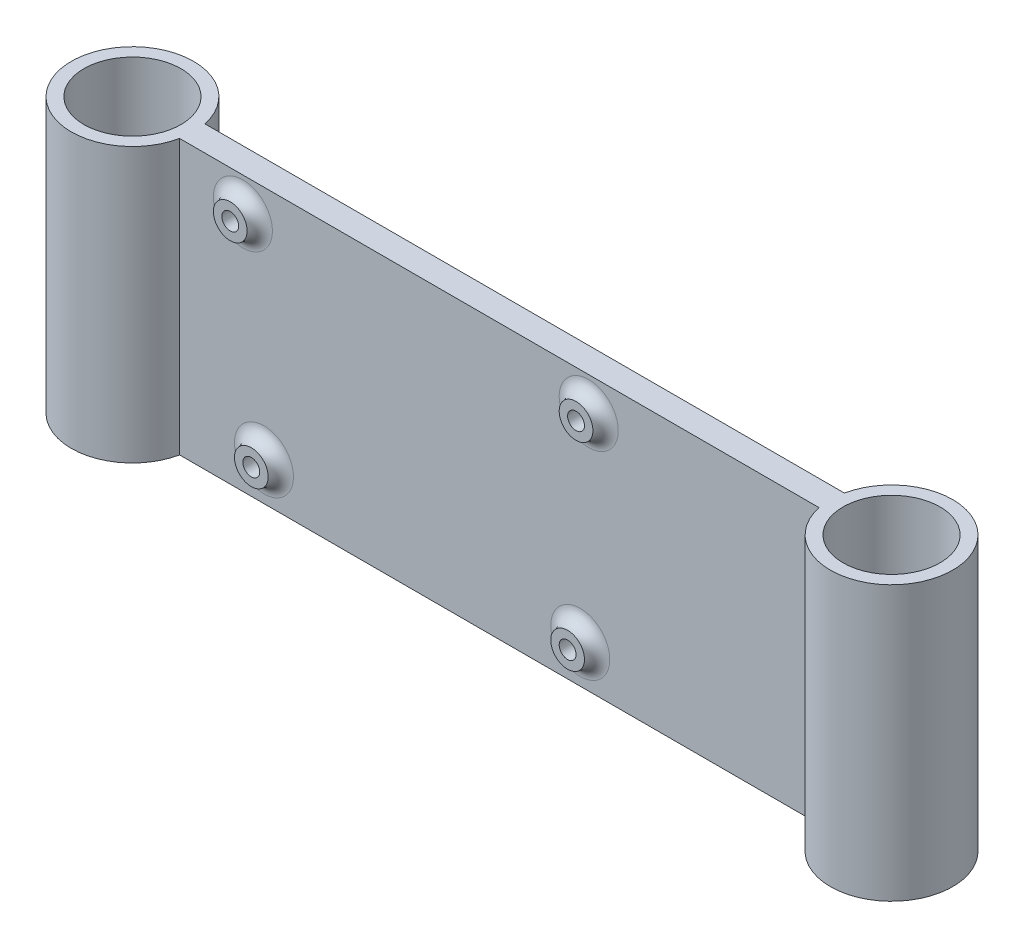
ISO-10303-21;
HEADER;
FILE_DESCRIPTION(('STEP AP214'),'2;1');
FILE_NAME('part.step','',(''),(''),'','','');
FILE_SCHEMA(('AUTOMOTIVE_DESIGN { 1 0 10303 214 1 1 1 1 }'));
ENDSEC;
DATA;
#1=APPLICATION_CONTEXT('core data for automotive mechanical design processes');
#2=APPLICATION_PROTOCOL_DEFINITION('international standard','automotive_design',2000,#1);
#3=PRODUCT_CONTEXT('',#1,'mechanical');
#4=PRODUCT('Part','Part','',(#3));
#5=PRODUCT_RELATED_PRODUCT_CATEGORY('part','',(#4));
#6=PRODUCT_DEFINITION_FORMATION('','',#4);
#7=PRODUCT_DEFINITION_CONTEXT('part definition',#1,'design');
#8=PRODUCT_DEFINITION('design','',#6,#7);
#9=PRODUCT_DEFINITION_SHAPE('','',#8);
#10=(LENGTH_UNIT() NAMED_UNIT(*) SI_UNIT(.MILLI.,.METRE.));
#11=(NAMED_UNIT(*) PLANE_ANGLE_UNIT() SI_UNIT($,.RADIAN.));
#12=(NAMED_UNIT(*) SI_UNIT($,.STERADIAN.) SOLID_ANGLE_UNIT());
#13=UNCERTAINTY_MEASURE_WITH_UNIT(LENGTH_MEASURE(1.E-05),#10,'distance_accuracy_value','');
#14=(GEOMETRIC_REPRESENTATION_CONTEXT(3) GLOBAL_UNCERTAINTY_ASSIGNED_CONTEXT((#13)) GLOBAL_UNIT_ASSIGNED_CONTEXT((#10,
#11,#12)) REPRESENTATION_CONTEXT('',''));
#15=CARTESIAN_POINT('',(0.,0.,0.));
#16=DIRECTION('',(0.,0.,1.));
#17=DIRECTION('',(1.,0.,0.));
#18=AXIS2_PLACEMENT_3D('',#15,#16,#17);
#19=CARTESIAN_POINT('',(-28.3531574831731,65.,3.00000000000001));
#20=DIRECTION('',(0.,0.,-1.));
#21=DIRECTION('',(-1.,0.,0.));
#22=AXIS2_PLACEMENT_3D('',#19,#20,#21);
#23=PLANE('',#22);
#24=CARTESIAN_POINT('',(68.6468425168269,57.,3.00000000000001));
#25=DIRECTION('',(0.,0.,-1.));
#26=DIRECTION('',(-1.,0.,0.));
#27=AXIS2_PLACEMENT_3D('',#24,#25,#26);
#28=CIRCLE('',#27,7.00000000000001);
#29=CARTESIAN_POINT('',(61.6468425168269,57.,3.00000000000001));
#30=VERTEX_POINT('',#29);
#31=EDGE_CURVE('E11',#30,#30,#28,.T.);
#32=ORIENTED_EDGE('',*,*,#31,.T.);
#33=EDGE_LOOP('',(#32));
#34=FACE_BOUND('',#33,.T.);
#35=CARTESIAN_POINT('',(66.6468425168269,9.,3.00000000000001));
#36=DIRECTION('',(0.,0.,-1.));
#37=DIRECTION('',(-1.,0.,0.));
#38=AXIS2_PLACEMENT_3D('',#35,#36,#37);
#39=CIRCLE('',#38,7.00000000000001);
#40=CARTESIAN_POINT('',(59.6468425168269,9.,3.00000000000001));
#41=VERTEX_POINT('',#40);
#42=EDGE_CURVE('E42',#41,#41,#39,.T.);
#43=ORIENTED_EDGE('',*,*,#42,.T.);
#44=EDGE_LOOP('',(#43));
#45=FACE_BOUND('',#44,.T.);
#46=CARTESIAN_POINT('',(-8.35315748317308,9.,3.00000000000001));
#47=DIRECTION('',(0.,0.,-1.));
#48=DIRECTION('',(-1.,0.,0.));
#49=AXIS2_PLACEMENT_3D('',#46,#47,#48);
#50=CIRCLE('',#49,7.00000000000001);
#51=CARTESIAN_POINT('',(-15.3531574831731,9.,3.00000000000001));
#52=VERTEX_POINT('',#51);
#53=EDGE_CURVE('E128',#52,#52,#50,.T.);
#54=ORIENTED_EDGE('',*,*,#53,.T.);
#55=EDGE_LOOP('',(#54));
#56=FACE_BOUND('',#55,.T.);
#57=CARTESIAN_POINT('',(-13.3531574831731,57.,3.00000000000001));
#58=DIRECTION('',(0.,0.,-1.));
#59=DIRECTION('',(-1.,0.,0.));
#60=AXIS2_PLACEMENT_3D('',#57,#58,#59);
#61=CIRCLE('',#60,7.00000000000001);
#62=CARTESIAN_POINT('',(-20.3531574831731,57.,3.00000000000001));
#63=VERTEX_POINT('',#62);
#64=EDGE_CURVE('E111',#63,#63,#61,.T.);
#65=ORIENTED_EDGE('',*,*,#64,.T.);
#66=EDGE_LOOP('',(#65));
#67=FACE_BOUND('',#66,.T.);
#68=DIRECTION('',(1.,0.,0.));
#69=VECTOR('',#68,1.);
#70=CARTESIAN_POINT('',(-28.3531574831731,0.,3.00000000000001));
#71=LINE('',#70,#69);
#72=CARTESIAN_POINT('',(-28.3531574831731,0.,3.00000000000001));
#73=VERTEX_POINT('',#72);
#74=CARTESIAN_POINT('',(123.274320598605,0.,3.00000000000001));
#75=VERTEX_POINT('',#74);
#76=EDGE_CURVE('E91',#73,#75,#71,.T.);
#77=ORIENTED_EDGE('',*,*,#76,.T.);
#78=DIRECTION('',(0.,-1.,0.));
#79=VECTOR('',#78,1.);
#80=CARTESIAN_POINT('',(123.274320598605,65.,3.00000000000001));
#81=LINE('',#80,#79);
#82=CARTESIAN_POINT('',(123.274320598605,65.,3.00000000000001));
#83=VERTEX_POINT('',#82);
#84=EDGE_CURVE('E90',#83,#75,#81,.T.);
#85=ORIENTED_EDGE('',*,*,#84,.F.);
#86=DIRECTION('',(1.,0.,0.));
#87=VECTOR('',#86,1.);
#88=CARTESIAN_POINT('',(-28.3531574831731,65.,3.00000000000001));
#89=LINE('',#88,#87);
#90=CARTESIAN_POINT('',(-28.3531574831731,65.,3.00000000000001));
#91=VERTEX_POINT('',#90);
#92=EDGE_CURVE('E81',#91,#83,#89,.T.);
#93=ORIENTED_EDGE('',*,*,#92,.F.);
#94=DIRECTION('',(0.,-1.,0.));
#95=VECTOR('',#94,1.);
#96=CARTESIAN_POINT('',(-28.3531574831731,65.,3.00000000000001));
#97=LINE('',#96,#95);
#98=EDGE_CURVE('E92',#91,#73,#97,.T.);
#99=ORIENTED_EDGE('',*,*,#98,.T.);
#100=EDGE_LOOP('',(#77,#85,#93,#99));
#101=FACE_BOUND('',#100,.T.);
#102=ADVANCED_FACE('F33',(#34,#45,#56,#67,#101),#23,.F.);
#103=CARTESIAN_POINT('',(-42.5394184422842,65.,0.));
#104=DIRECTION('',(0.,-1.,0.));
#105=DIRECTION('',(0.,0.,-1.));
#106=AXIS2_PLACEMENT_3D('',#103,#104,#105);
#107=PLANE('',#106);
#108=CARTESIAN_POINT('',(-42.5394184422842,65.,0.));
#109=DIRECTION('',(0.,1.,0.));
#110=DIRECTION('',(0.,0.,-1.));
#111=AXIS2_PLACEMENT_3D('',#108,#109,#110);
#112=CIRCLE('',#111,14.5);
#113=CARTESIAN_POINT('',(-28.3531574831731,65.,-2.99999999999999));
#114=VERTEX_POINT('',#113);
#115=EDGE_CURVE('E87',#114,#91,#112,.T.);
#116=ORIENTED_EDGE('',*,*,#115,.T.);
#117=ORIENTED_EDGE('',*,*,#92,.T.);
#118=CARTESIAN_POINT('',(137.460581557716,65.,0.));
#119=DIRECTION('',(0.,1.,0.));
#120=DIRECTION('',(0.,0.,-1.));
#121=AXIS2_PLACEMENT_3D('',#118,#119,#120);
#122=CIRCLE('',#121,14.5);
#123=CARTESIAN_POINT('',(123.274320598605,65.,-2.99999999999999));
#124=VERTEX_POINT('',#123);
#125=EDGE_CURVE('E85',#83,#124,#122,.T.);
#126=ORIENTED_EDGE('',*,*,#125,.T.);
#127=DIRECTION('',(-1.,0.,0.));
#128=VECTOR('',#127,1.);
#129=CARTESIAN_POINT('',(-28.3531574831731,65.,-2.99999999999999));
#130=LINE('',#129,#128);
#131=EDGE_CURVE('E50',#124,#114,#130,.T.);
#132=ORIENTED_EDGE('',*,*,#131,.T.);
#133=EDGE_LOOP('',(#116,#117,#126,#132));
#134=FACE_BOUND('',#133,.T.);
#135=CARTESIAN_POINT('',(-42.5394184422842,65.,0.));
#136=DIRECTION('',(0.,1.,0.));
#137=DIRECTION('',(0.,0.,1.));
#138=AXIS2_PLACEMENT_3D('',#135,#136,#137);
#139=CIRCLE('',#138,11.5);
#140=CARTESIAN_POINT('',(-42.5394184422842,65.,11.5));
#141=VERTEX_POINT('',#140);
#142=EDGE_CURVE('E104',#141,#141,#139,.T.);
#143=ORIENTED_EDGE('',*,*,#142,.F.);
#144=EDGE_LOOP('',(#143));
#145=FACE_BOUND('',#144,.T.);
#146=CARTESIAN_POINT('',(137.460581557716,65.,0.));
#147=DIRECTION('',(0.,1.,0.));
#148=DIRECTION('',(0.,0.,1.));
#149=AXIS2_PLACEMENT_3D('',#146,#147,#148);
#150=CIRCLE('',#149,11.5);
#151=CARTESIAN_POINT('',(137.460581557716,65.,11.5));
#152=VERTEX_POINT('',#151);
#153=EDGE_CURVE('E167',#152,#152,#150,.T.);
#154=ORIENTED_EDGE('',*,*,#153,.F.);
#155=EDGE_LOOP('',(#154));
#156=FACE_BOUND('',#155,.T.);
#157=ADVANCED_FACE('F82',(#134,#145,#156),#107,.F.);
#158=CARTESIAN_POINT('',(-42.5394184422842,0.,0.));
#159=DIRECTION('',(0.,-1.,0.));
#160=DIRECTION('',(0.,0.,-1.));
#161=AXIS2_PLACEMENT_3D('',#158,#159,#160);
#162=PLANE('',#161);
#163=CARTESIAN_POINT('',(-42.5394184422842,0.,0.));
#164=DIRECTION('',(0.,1.,0.));
#165=DIRECTION('',(0.,0.,1.));
#166=AXIS2_PLACEMENT_3D('',#163,#164,#165);
#167=CIRCLE('',#166,11.5);
#168=CARTESIAN_POINT('',(-42.5394184422842,0.,11.5));
#169=VERTEX_POINT('',#168);
#170=EDGE_CURVE('E170',#169,#169,#167,.T.);
#171=ORIENTED_EDGE('',*,*,#170,.T.);
#172=EDGE_LOOP('',(#171));
#173=FACE_BOUND('',#172,.T.);
#174=CARTESIAN_POINT('',(-42.5394184422842,0.,0.));
#175=DIRECTION('',(0.,1.,0.));
#176=DIRECTION('',(0.,0.,-1.));
#177=AXIS2_PLACEMENT_3D('',#174,#175,#176);
#178=CIRCLE('',#177,14.5);
#179=CARTESIAN_POINT('',(-28.3531574831731,0.,-2.99999999999999));
#180=VERTEX_POINT('',#179);
#181=EDGE_CURVE('E101',#180,#73,#178,.T.);
#182=ORIENTED_EDGE('',*,*,#181,.F.);
#183=DIRECTION('',(-1.,0.,0.));
#184=VECTOR('',#183,1.);
#185=CARTESIAN_POINT('',(-28.3531574831731,0.,-2.99999999999999));
#186=LINE('',#185,#184);
#187=CARTESIAN_POINT('',(123.274320598605,0.,-2.99999999999999));
#188=VERTEX_POINT('',#187);
#189=EDGE_CURVE('E73',#188,#180,#186,.T.);
#190=ORIENTED_EDGE('',*,*,#189,.F.);
#191=CARTESIAN_POINT('',(137.460581557716,0.,0.));
#192=DIRECTION('',(0.,1.,0.));
#193=DIRECTION('',(0.,0.,-1.));
#194=AXIS2_PLACEMENT_3D('',#191,#192,#193);
#195=CIRCLE('',#194,14.5);
#196=EDGE_CURVE('E67',#75,#188,#195,.T.);
#197=ORIENTED_EDGE('',*,*,#196,.F.);
#198=ORIENTED_EDGE('',*,*,#76,.F.);
#199=EDGE_LOOP('',(#182,#190,#197,#198));
#200=FACE_BOUND('',#199,.T.);
#201=CARTESIAN_POINT('',(137.460581557716,0.,0.));
#202=DIRECTION('',(0.,1.,0.));
#203=DIRECTION('',(0.,0.,1.));
#204=AXIS2_PLACEMENT_3D('',#201,#202,#203);
#205=CIRCLE('',#204,11.5);
#206=CARTESIAN_POINT('',(137.460581557716,0.,11.5));
#207=VERTEX_POINT('',#206);
#208=EDGE_CURVE('E115',#207,#207,#205,.T.);
#209=ORIENTED_EDGE('',*,*,#208,.T.);
#210=EDGE_LOOP('',(#209));
#211=FACE_BOUND('',#210,.T.);
#212=ADVANCED_FACE('F178',(#173,#200,#211),#162,.T.);
#213=CARTESIAN_POINT('',(-42.5394184422842,65.,0.));
#214=DIRECTION('',(0.,-1.,0.));
#215=DIRECTION('',(0.,0.,-1.));
#216=AXIS2_PLACEMENT_3D('',#213,#214,#215);
#217=CYLINDRICAL_SURFACE('',#216,14.5);
#218=ORIENTED_EDGE('',*,*,#181,.T.);
#219=ORIENTED_EDGE('',*,*,#98,.F.);
#220=ORIENTED_EDGE('',*,*,#115,.F.);
#221=DIRECTION('',(0.,-1.,0.));
#222=VECTOR('',#221,1.);
#223=CARTESIAN_POINT('',(-28.3531574831731,65.,-2.99999999999999));
#224=LINE('',#223,#222);
#225=EDGE_CURVE('E97',#114,#180,#224,.T.);
#226=ORIENTED_EDGE('',*,*,#225,.T.);
#227=EDGE_LOOP('',(#218,#219,#220,#226));
#228=FACE_BOUND('',#227,.T.);
#229=ADVANCED_FACE('F205',(#228),#217,.T.);
#230=CARTESIAN_POINT('',(137.460581557716,65.,0.));
#231=DIRECTION('',(0.,-1.,0.));
#232=DIRECTION('',(0.,0.,-1.));
#233=AXIS2_PLACEMENT_3D('',#230,#231,#232);
#234=CYLINDRICAL_SURFACE('',#233,14.5);
#235=ORIENTED_EDGE('',*,*,#196,.T.);
#236=DIRECTION('',(0.,-1.,0.));
#237=VECTOR('',#236,1.);
#238=CARTESIAN_POINT('',(123.274320598605,65.,-2.99999999999999));
#239=LINE('',#238,#237);
#240=EDGE_CURVE('E93',#124,#188,#239,.T.);
#241=ORIENTED_EDGE('',*,*,#240,.F.);
#242=ORIENTED_EDGE('',*,*,#125,.F.);
#243=ORIENTED_EDGE('',*,*,#84,.T.);
#244=EDGE_LOOP('',(#235,#241,#242,#243));
#245=FACE_BOUND('',#244,.T.);
#246=ADVANCED_FACE('F95',(#245),#234,.T.);
#247=CARTESIAN_POINT('',(-28.3531574831731,65.,-2.99999999999999));
#248=DIRECTION('',(0.,0.,1.));
#249=DIRECTION('',(1.,0.,0.));
#250=AXIS2_PLACEMENT_3D('',#247,#248,#249);
#251=PLANE('',#250);
#252=CARTESIAN_POINT('',(-8.35315748317308,9.,-2.99999999999999));
#253=DIRECTION('',(0.,0.,1.));
#254=DIRECTION('',(1.,0.,0.));
#255=AXIS2_PLACEMENT_3D('',#252,#253,#254);
#256=CIRCLE('',#255,2.);
#257=CARTESIAN_POINT('',(-6.35315748317308,9.,-2.99999999999999));
#258=VERTEX_POINT('',#257);
#259=EDGE_CURVE('E116',#258,#258,#256,.T.);
#260=ORIENTED_EDGE('',*,*,#259,.T.);
#261=EDGE_LOOP('',(#260));
#262=FACE_BOUND('',#261,.T.);
#263=CARTESIAN_POINT('',(66.6468425168269,9.,-2.99999999999999));
#264=DIRECTION('',(0.,0.,1.));
#265=DIRECTION('',(1.,0.,0.));
#266=AXIS2_PLACEMENT_3D('',#263,#264,#265);
#267=CIRCLE('',#266,2.);
#268=CARTESIAN_POINT('',(68.6468425168269,9.,-2.99999999999999));
#269=VERTEX_POINT('',#268);
#270=EDGE_CURVE('E120',#269,#269,#267,.T.);
#271=ORIENTED_EDGE('',*,*,#270,.T.);
#272=EDGE_LOOP('',(#271));
#273=FACE_BOUND('',#272,.T.);
#274=CARTESIAN_POINT('',(68.6468425168269,57.,-2.99999999999999));
#275=DIRECTION('',(0.,0.,1.));
#276=DIRECTION('',(1.,0.,0.));
#277=AXIS2_PLACEMENT_3D('',#274,#275,#276);
#278=CIRCLE('',#277,2.);
#279=CARTESIAN_POINT('',(70.6468425168269,57.,-2.99999999999999));
#280=VERTEX_POINT('',#279);
#281=EDGE_CURVE('E117',#280,#280,#278,.T.);
#282=ORIENTED_EDGE('',*,*,#281,.T.);
#283=EDGE_LOOP('',(#282));
#284=FACE_BOUND('',#283,.T.);
#285=CARTESIAN_POINT('',(-13.3531574831731,57.,-2.99999999999999));
#286=DIRECTION('',(0.,0.,1.));
#287=DIRECTION('',(1.,0.,0.));
#288=AXIS2_PLACEMENT_3D('',#285,#286,#287);
#289=CIRCLE('',#288,2.);
#290=CARTESIAN_POINT('',(-11.3531574831731,57.,-2.99999999999999));
#291=VERTEX_POINT('',#290);
#292=EDGE_CURVE('E112',#291,#291,#289,.T.);
#293=ORIENTED_EDGE('',*,*,#292,.T.);
#294=EDGE_LOOP('',(#293));
#295=FACE_BOUND('',#294,.T.);
#296=ORIENTED_EDGE('',*,*,#189,.T.);
#297=ORIENTED_EDGE('',*,*,#225,.F.);
#298=ORIENTED_EDGE('',*,*,#131,.F.);
#299=ORIENTED_EDGE('',*,*,#240,.T.);
#300=EDGE_LOOP('',(#296,#297,#298,#299));
#301=FACE_BOUND('',#300,.T.);
#302=ADVANCED_FACE('F184',(#262,#273,#284,#295,#301),#251,.F.);
#303=CARTESIAN_POINT('',(-42.5394184422842,65.,0.));
#304=DIRECTION('',(0.,-1.,0.));
#305=DIRECTION('',(0.,0.,-1.));
#306=AXIS2_PLACEMENT_3D('',#303,#304,#305);
#307=CYLINDRICAL_SURFACE('',#306,11.5);
#308=ORIENTED_EDGE('',*,*,#142,.T.);
#309=EDGE_LOOP('',(#308));
#310=FACE_BOUND('',#309,.T.);
#311=ORIENTED_EDGE('',*,*,#170,.F.);
#312=EDGE_LOOP('',(#311));
#313=FACE_BOUND('',#312,.T.);
#314=ADVANCED_FACE('F181',(#310,#313),#307,.F.);
#315=CARTESIAN_POINT('',(137.460581557716,65.,0.));
#316=DIRECTION('',(0.,-1.,0.));
#317=DIRECTION('',(0.,0.,-1.));
#318=AXIS2_PLACEMENT_3D('',#315,#316,#317);
#319=CYLINDRICAL_SURFACE('',#318,11.5);
#320=ORIENTED_EDGE('',*,*,#153,.T.);
#321=EDGE_LOOP('',(#320));
#322=FACE_BOUND('',#321,.T.);
#323=ORIENTED_EDGE('',*,*,#208,.F.);
#324=EDGE_LOOP('',(#323));
#325=FACE_BOUND('',#324,.T.);
#326=ADVANCED_FACE('F183',(#322,#325),#319,.F.);
#327=CARTESIAN_POINT('',(-13.3531574831731,57.,-6.99999999999999));
#328=DIRECTION('',(0.,0.,1.));
#329=DIRECTION('',(1.,0.,0.));
#330=AXIS2_PLACEMENT_3D('',#327,#328,#329);
#331=CYLINDRICAL_SURFACE('',#330,2.);
#332=ORIENTED_EDGE('',*,*,#292,.F.);
#333=EDGE_LOOP('',(#332));
#334=FACE_BOUND('',#333,.T.);
#335=CARTESIAN_POINT('',(-13.3531574831731,57.,6.00000000000001));
#336=DIRECTION('',(0.,0.,1.));
#337=DIRECTION('',(1.,0.,0.));
#338=AXIS2_PLACEMENT_3D('',#335,#336,#337);
#339=CIRCLE('',#338,2.00000000000001);
#340=CARTESIAN_POINT('',(-11.3531574831731,57.,6.00000000000001));
#341=VERTEX_POINT('',#340);
#342=EDGE_CURVE('E162',#341,#341,#339,.T.);
#343=ORIENTED_EDGE('',*,*,#342,.T.);
#344=EDGE_LOOP('',(#343));
#345=FACE_BOUND('',#344,.T.);
#346=ADVANCED_FACE('F191',(#334,#345),#331,.F.);
#347=CARTESIAN_POINT('',(68.6468425168269,57.,-6.99999999999999));
#348=DIRECTION('',(0.,0.,1.));
#349=DIRECTION('',(1.,0.,0.));
#350=AXIS2_PLACEMENT_3D('',#347,#348,#349);
#351=CYLINDRICAL_SURFACE('',#350,2.);
#352=ORIENTED_EDGE('',*,*,#281,.F.);
#353=EDGE_LOOP('',(#352));
#354=FACE_BOUND('',#353,.T.);
#355=CARTESIAN_POINT('',(68.6468425168269,57.,6.00000000000001));
#356=DIRECTION('',(0.,0.,1.));
#357=DIRECTION('',(1.,0.,0.));
#358=AXIS2_PLACEMENT_3D('',#355,#356,#357);
#359=CIRCLE('',#358,2.00000000000001);
#360=CARTESIAN_POINT('',(70.6468425168269,57.,6.00000000000001));
#361=VERTEX_POINT('',#360);
#362=EDGE_CURVE('E156',#361,#361,#359,.T.);
#363=ORIENTED_EDGE('',*,*,#362,.T.);
#364=EDGE_LOOP('',(#363));
#365=FACE_BOUND('',#364,.T.);
#366=ADVANCED_FACE('F241',(#354,#365),#351,.F.);
#367=CARTESIAN_POINT('',(66.6468425168269,9.,-6.99999999999999));
#368=DIRECTION('',(0.,0.,1.));
#369=DIRECTION('',(1.,0.,0.));
#370=AXIS2_PLACEMENT_3D('',#367,#368,#369);
#371=CYLINDRICAL_SURFACE('',#370,2.);
#372=ORIENTED_EDGE('',*,*,#270,.F.);
#373=EDGE_LOOP('',(#372));
#374=FACE_BOUND('',#373,.T.);
#375=CARTESIAN_POINT('',(66.6468425168269,9.,6.00000000000001));
#376=DIRECTION('',(0.,0.,1.));
#377=DIRECTION('',(1.,0.,0.));
#378=AXIS2_PLACEMENT_3D('',#375,#376,#377);
#379=CIRCLE('',#378,2.);
#380=CARTESIAN_POINT('',(68.6468425168269,9.,6.00000000000001));
#381=VERTEX_POINT('',#380);
#382=EDGE_CURVE('E146',#381,#381,#379,.T.);
#383=ORIENTED_EDGE('',*,*,#382,.T.);
#384=EDGE_LOOP('',(#383));
#385=FACE_BOUND('',#384,.T.);
#386=ADVANCED_FACE('F232',(#374,#385),#371,.F.);
#387=CARTESIAN_POINT('',(-8.35315748317308,9.,-6.99999999999999));
#388=DIRECTION('',(0.,0.,1.));
#389=DIRECTION('',(1.,0.,0.));
#390=AXIS2_PLACEMENT_3D('',#387,#388,#389);
#391=CYLINDRICAL_SURFACE('',#390,2.);
#392=ORIENTED_EDGE('',*,*,#259,.F.);
#393=EDGE_LOOP('',(#392));
#394=FACE_BOUND('',#393,.T.);
#395=CARTESIAN_POINT('',(-8.35315748317308,9.,6.00000000000001));
#396=DIRECTION('',(0.,0.,1.));
#397=DIRECTION('',(1.,0.,0.));
#398=AXIS2_PLACEMENT_3D('',#395,#396,#397);
#399=CIRCLE('',#398,2.);
#400=CARTESIAN_POINT('',(-6.35315748317308,9.,6.00000000000001));
#401=VERTEX_POINT('',#400);
#402=EDGE_CURVE('E145',#401,#401,#399,.T.);
#403=ORIENTED_EDGE('',*,*,#402,.T.);
#404=EDGE_LOOP('',(#403));
#405=FACE_BOUND('',#404,.T.);
#406=ADVANCED_FACE('F229',(#394,#405),#391,.F.);
#407=CARTESIAN_POINT('',(-13.3531574831731,57.,6.00000000000001));
#408=DIRECTION('',(0.,0.,1.));
#409=DIRECTION('',(1.,0.,0.));
#410=AXIS2_PLACEMENT_3D('',#407,#408,#409);
#411=PLANE('',#410);
#412=CARTESIAN_POINT('',(-13.3531574831731,57.,6.00000000000001));
#413=DIRECTION('',(0.,0.,1.));
#414=DIRECTION('',(1.,0.,0.));
#415=AXIS2_PLACEMENT_3D('',#412,#413,#414);
#416=CIRCLE('',#415,4.00000000000001);
#417=CARTESIAN_POINT('',(-9.35315748317307,57.,6.00000000000001));
#418=VERTEX_POINT('',#417);
#419=EDGE_CURVE('E121',#418,#418,#416,.T.);
#420=ORIENTED_EDGE('',*,*,#419,.T.);
#421=EDGE_LOOP('',(#420));
#422=FACE_BOUND('',#421,.T.);
#423=ORIENTED_EDGE('',*,*,#342,.F.);
#424=EDGE_LOOP('',(#423));
#425=FACE_BOUND('',#424,.T.);
#426=ADVANCED_FACE('F231',(#422,#425),#411,.T.);
#427=CARTESIAN_POINT('',(68.6468425168269,57.,6.00000000000001));
#428=DIRECTION('',(0.,0.,1.));
#429=DIRECTION('',(1.,0.,0.));
#430=AXIS2_PLACEMENT_3D('',#427,#428,#429);
#431=PLANE('',#430);
#432=CARTESIAN_POINT('',(68.6468425168269,57.,6.00000000000001));
#433=DIRECTION('',(0.,0.,1.));
#434=DIRECTION('',(1.,0.,0.));
#435=AXIS2_PLACEMENT_3D('',#432,#433,#434);
#436=CIRCLE('',#435,4.00000000000001);
#437=CARTESIAN_POINT('',(72.6468425168269,57.,6.00000000000001));
#438=VERTEX_POINT('',#437);
#439=EDGE_CURVE('E159',#438,#438,#436,.T.);
#440=ORIENTED_EDGE('',*,*,#439,.T.);
#441=EDGE_LOOP('',(#440));
#442=FACE_BOUND('',#441,.T.);
#443=ORIENTED_EDGE('',*,*,#362,.F.);
#444=EDGE_LOOP('',(#443));
#445=FACE_BOUND('',#444,.T.);
#446=ADVANCED_FACE('F225',(#442,#445),#431,.T.);
#447=CARTESIAN_POINT('',(-8.35315748317308,9.,6.00000000000001));
#448=DIRECTION('',(0.,0.,1.));
#449=DIRECTION('',(1.,0.,0.));
#450=AXIS2_PLACEMENT_3D('',#447,#448,#449);
#451=PLANE('',#450);
#452=CARTESIAN_POINT('',(-8.35315748317308,9.,6.00000000000001));
#453=DIRECTION('',(0.,0.,1.));
#454=DIRECTION('',(1.,0.,0.));
#455=AXIS2_PLACEMENT_3D('',#452,#453,#454);
#456=CIRCLE('',#455,4.00000000000001);
#457=CARTESIAN_POINT('',(-4.35315748317307,9.,6.00000000000001));
#458=VERTEX_POINT('',#457);
#459=EDGE_CURVE('E149',#458,#458,#456,.T.);
#460=ORIENTED_EDGE('',*,*,#459,.T.);
#461=EDGE_LOOP('',(#460));
#462=FACE_BOUND('',#461,.T.);
#463=ORIENTED_EDGE('',*,*,#402,.F.);
#464=EDGE_LOOP('',(#463));
#465=FACE_BOUND('',#464,.T.);
#466=ADVANCED_FACE('F222',(#462,#465),#451,.T.);
#467=CARTESIAN_POINT('',(66.6468425168269,9.,6.00000000000001));
#468=DIRECTION('',(0.,0.,1.));
#469=DIRECTION('',(1.,0.,0.));
#470=AXIS2_PLACEMENT_3D('',#467,#468,#469);
#471=PLANE('',#470);
#472=CARTESIAN_POINT('',(66.6468425168269,9.,6.00000000000001));
#473=DIRECTION('',(0.,0.,1.));
#474=DIRECTION('',(1.,0.,0.));
#475=AXIS2_PLACEMENT_3D('',#472,#473,#474);
#476=CIRCLE('',#475,4.00000000000001);
#477=CARTESIAN_POINT('',(70.6468425168269,9.,6.00000000000001));
#478=VERTEX_POINT('',#477);
#479=EDGE_CURVE('E143',#478,#478,#476,.T.);
#480=ORIENTED_EDGE('',*,*,#479,.T.);
#481=EDGE_LOOP('',(#480));
#482=FACE_BOUND('',#481,.T.);
#483=ORIENTED_EDGE('',*,*,#382,.F.);
#484=EDGE_LOOP('',(#483));
#485=FACE_BOUND('',#484,.T.);
#486=ADVANCED_FACE('F210',(#482,#485),#471,.T.);
#487=CARTESIAN_POINT('',(68.6468425168269,57.,6.00000000000001));
#488=DIRECTION('',(0.,0.,-1.));
#489=DIRECTION('',(-1.,0.,0.));
#490=AXIS2_PLACEMENT_3D('',#487,#488,#489);
#491=TOROIDAL_SURFACE('',#490,7.00000000000001,3.);
#492=ORIENTED_EDGE('',*,*,#31,.F.);
#493=EDGE_LOOP('',(#492));
#494=FACE_BOUND('',#493,.T.);
#495=ORIENTED_EDGE('',*,*,#439,.F.);
#496=EDGE_LOOP('',(#495));
#497=FACE_BOUND('',#496,.T.);
#498=ADVANCED_FACE('F139',(#494,#497),#491,.F.);
#499=CARTESIAN_POINT('',(66.6468425168269,9.,6.00000000000001));
#500=DIRECTION('',(0.,0.,-1.));
#501=DIRECTION('',(-1.,0.,0.));
#502=AXIS2_PLACEMENT_3D('',#499,#500,#501);
#503=TOROIDAL_SURFACE('',#502,7.00000000000001,3.);
#504=ORIENTED_EDGE('',*,*,#42,.F.);
#505=EDGE_LOOP('',(#504));
#506=FACE_BOUND('',#505,.T.);
#507=ORIENTED_EDGE('',*,*,#479,.F.);
#508=EDGE_LOOP('',(#507));
#509=FACE_BOUND('',#508,.T.);
#510=ADVANCED_FACE('F135',(#506,#509),#503,.F.);
#511=CARTESIAN_POINT('',(-8.35315748317308,9.,6.00000000000001));
#512=DIRECTION('',(0.,0.,-1.));
#513=DIRECTION('',(-1.,0.,0.));
#514=AXIS2_PLACEMENT_3D('',#511,#512,#513);
#515=TOROIDAL_SURFACE('',#514,7.00000000000001,3.);
#516=ORIENTED_EDGE('',*,*,#53,.F.);
#517=EDGE_LOOP('',(#516));
#518=FACE_BOUND('',#517,.T.);
#519=ORIENTED_EDGE('',*,*,#459,.F.);
#520=EDGE_LOOP('',(#519));
#521=FACE_BOUND('',#520,.T.);
#522=ADVANCED_FACE('F138',(#518,#521),#515,.F.);
#523=CARTESIAN_POINT('',(-13.3531574831731,57.,6.00000000000001));
#524=DIRECTION('',(0.,0.,-1.));
#525=DIRECTION('',(-1.,0.,0.));
#526=AXIS2_PLACEMENT_3D('',#523,#524,#525);
#527=TOROIDAL_SURFACE('',#526,7.00000000000001,3.);
#528=ORIENTED_EDGE('',*,*,#64,.F.);
#529=EDGE_LOOP('',(#528));
#530=FACE_BOUND('',#529,.T.);
#531=ORIENTED_EDGE('',*,*,#419,.F.);
#532=EDGE_LOOP('',(#531));
#533=FACE_BOUND('',#532,.T.);
#534=ADVANCED_FACE('F35',(#530,#533),#527,.F.);
#535=CLOSED_SHELL('',(#102,#157,#212,#229,#246,#302,#314,#326,#346,#366,#386,#406,#426,#446,
#466,#486,#498,#510,#522,#534));
#536=MANIFOLD_SOLID_BREP('B2',#535);
#537=ADVANCED_BREP_SHAPE_REPRESENTATION('',(#18,#536),#14);
#538=SHAPE_DEFINITION_REPRESENTATION(#9,#537);
ENDSEC;
END-ISO-10303-21;
